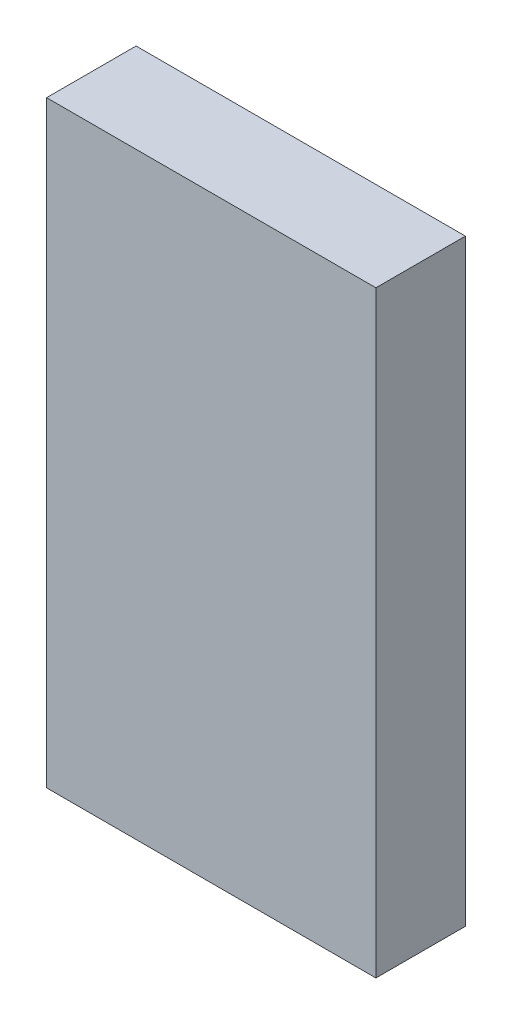
ISO-10303-21;
HEADER;
FILE_DESCRIPTION(('STEP AP214'),'2;1');
FILE_NAME('part.step','',(''),(''),'','','');
FILE_SCHEMA(('AUTOMOTIVE_DESIGN { 1 0 10303 214 1 1 1 1 }'));
ENDSEC;
DATA;
#1=APPLICATION_CONTEXT('core data for automotive mechanical design processes');
#2=APPLICATION_PROTOCOL_DEFINITION('international standard','automotive_design',2000,#1);
#3=PRODUCT_CONTEXT('',#1,'mechanical');
#4=PRODUCT('Part','Part','',(#3));
#5=PRODUCT_RELATED_PRODUCT_CATEGORY('part','',(#4));
#6=PRODUCT_DEFINITION_FORMATION('','',#4);
#7=PRODUCT_DEFINITION_CONTEXT('part definition',#1,'design');
#8=PRODUCT_DEFINITION('design','',#6,#7);
#9=PRODUCT_DEFINITION_SHAPE('','',#8);
#10=(LENGTH_UNIT() NAMED_UNIT(*) SI_UNIT(.MILLI.,.METRE.));
#11=(NAMED_UNIT(*) PLANE_ANGLE_UNIT() SI_UNIT($,.RADIAN.));
#12=(NAMED_UNIT(*) SI_UNIT($,.STERADIAN.) SOLID_ANGLE_UNIT());
#13=UNCERTAINTY_MEASURE_WITH_UNIT(LENGTH_MEASURE(1.E-05),#10,'distance_accuracy_value','');
#14=(GEOMETRIC_REPRESENTATION_CONTEXT(3) GLOBAL_UNCERTAINTY_ASSIGNED_CONTEXT((#13)) GLOBAL_UNIT_ASSIGNED_CONTEXT((#10,
#11,#12)) REPRESENTATION_CONTEXT('',''));
#15=CARTESIAN_POINT('',(0.,0.,0.));
#16=DIRECTION('',(0.,0.,1.));
#17=DIRECTION('',(1.,0.,0.));
#18=AXIS2_PLACEMENT_3D('',#15,#16,#17);
#19=CARTESIAN_POINT('',(-0.514,0.771,0.));
#20=DIRECTION('',(1.,0.,0.));
#21=DIRECTION('',(0.,0.,1.));
#22=AXIS2_PLACEMENT_3D('',#19,#20,#21);
#23=PLANE('',#22);
#24=DIRECTION('',(0.,1.,0.));
#25=VECTOR('',#24,1.);
#26=CARTESIAN_POINT('',(-0.514,0.771,0.1));
#27=LINE('',#26,#25);
#28=CARTESIAN_POINT('',(-0.514,0.771,0.1));
#29=VERTEX_POINT('',#28);
#30=CARTESIAN_POINT('',(-0.514,1.439,0.1));
#31=VERTEX_POINT('',#30);
#32=EDGE_CURVE('E11',#29,#31,#27,.T.);
#33=ORIENTED_EDGE('',*,*,#32,.T.);
#34=DIRECTION('',(0.,0.,1.));
#35=VECTOR('',#34,1.);
#36=CARTESIAN_POINT('',(-0.514,1.439,0.));
#37=LINE('',#36,#35);
#38=CARTESIAN_POINT('',(-0.514,1.439,0.));
#39=VERTEX_POINT('',#38);
#40=EDGE_CURVE('E24',#39,#31,#37,.T.);
#41=ORIENTED_EDGE('',*,*,#40,.F.);
#42=DIRECTION('',(0.,1.,0.));
#43=VECTOR('',#42,1.);
#44=CARTESIAN_POINT('',(-0.514,0.771,0.));
#45=LINE('',#44,#43);
#46=CARTESIAN_POINT('',(-0.514,0.771,0.));
#47=VERTEX_POINT('',#46);
#48=EDGE_CURVE('E86',#47,#39,#45,.T.);
#49=ORIENTED_EDGE('',*,*,#48,.F.);
#50=DIRECTION('',(0.,0.,1.));
#51=VECTOR('',#50,1.);
#52=CARTESIAN_POINT('',(-0.514,0.771,0.));
#53=LINE('',#52,#51);
#54=EDGE_CURVE('E36',#47,#29,#53,.T.);
#55=ORIENTED_EDGE('',*,*,#54,.T.);
#56=EDGE_LOOP('',(#33,#41,#49,#55));
#57=FACE_BOUND('',#56,.T.);
#58=ADVANCED_FACE('F17',(#57),#23,.F.);
#59=CARTESIAN_POINT('',(-0.146,0.771,0.));
#60=DIRECTION('',(1.,0.,0.));
#61=DIRECTION('',(0.,0.,1.));
#62=AXIS2_PLACEMENT_3D('',#59,#60,#61);
#63=PLANE('',#62);
#64=DIRECTION('',(0.,0.,1.));
#65=VECTOR('',#64,1.);
#66=CARTESIAN_POINT('',(-0.146,0.771,0.));
#67=LINE('',#66,#65);
#68=CARTESIAN_POINT('',(-0.146,0.771,0.));
#69=VERTEX_POINT('',#68);
#70=CARTESIAN_POINT('',(-0.146,0.771,0.1));
#71=VERTEX_POINT('',#70);
#72=EDGE_CURVE('E83',#69,#71,#67,.T.);
#73=ORIENTED_EDGE('',*,*,#72,.F.);
#74=DIRECTION('',(0.,1.,0.));
#75=VECTOR('',#74,1.);
#76=CARTESIAN_POINT('',(-0.146,0.771,0.));
#77=LINE('',#76,#75);
#78=CARTESIAN_POINT('',(-0.146,1.439,0.));
#79=VERTEX_POINT('',#78);
#80=EDGE_CURVE('E63',#69,#79,#77,.T.);
#81=ORIENTED_EDGE('',*,*,#80,.T.);
#82=DIRECTION('',(0.,0.,1.));
#83=VECTOR('',#82,1.);
#84=CARTESIAN_POINT('',(-0.146,1.439,0.));
#85=LINE('',#84,#83);
#86=CARTESIAN_POINT('',(-0.146,1.439,0.1));
#87=VERTEX_POINT('',#86);
#88=EDGE_CURVE('E57',#79,#87,#85,.T.);
#89=ORIENTED_EDGE('',*,*,#88,.T.);
#90=DIRECTION('',(0.,1.,0.));
#91=VECTOR('',#90,1.);
#92=CARTESIAN_POINT('',(-0.146,0.771,0.1));
#93=LINE('',#92,#91);
#94=EDGE_CURVE('E60',#71,#87,#93,.T.);
#95=ORIENTED_EDGE('',*,*,#94,.F.);
#96=EDGE_LOOP('',(#73,#81,#89,#95));
#97=FACE_BOUND('',#96,.T.);
#98=ADVANCED_FACE('F59',(#97),#63,.T.);
#99=CARTESIAN_POINT('',(-0.514,0.771,0.));
#100=DIRECTION('',(0.,1.,0.));
#101=DIRECTION('',(0.,0.,1.));
#102=AXIS2_PLACEMENT_3D('',#99,#100,#101);
#103=PLANE('',#102);
#104=ORIENTED_EDGE('',*,*,#72,.T.);
#105=DIRECTION('',(1.,0.,0.));
#106=VECTOR('',#105,1.);
#107=CARTESIAN_POINT('',(-0.514,0.771,0.1));
#108=LINE('',#107,#106);
#109=EDGE_CURVE('E71',#29,#71,#108,.T.);
#110=ORIENTED_EDGE('',*,*,#109,.F.);
#111=ORIENTED_EDGE('',*,*,#54,.F.);
#112=DIRECTION('',(1.,0.,0.));
#113=VECTOR('',#112,1.);
#114=CARTESIAN_POINT('',(-0.514,0.771,0.));
#115=LINE('',#114,#113);
#116=EDGE_CURVE('E76',#47,#69,#115,.T.);
#117=ORIENTED_EDGE('',*,*,#116,.T.);
#118=EDGE_LOOP('',(#104,#110,#111,#117));
#119=FACE_BOUND('',#118,.T.);
#120=ADVANCED_FACE('F91',(#119),#103,.F.);
#121=CARTESIAN_POINT('',(-0.514,1.439,0.));
#122=DIRECTION('',(0.,1.,0.));
#123=DIRECTION('',(0.,0.,1.));
#124=AXIS2_PLACEMENT_3D('',#121,#122,#123);
#125=PLANE('',#124);
#126=DIRECTION('',(1.,0.,0.));
#127=VECTOR('',#126,1.);
#128=CARTESIAN_POINT('',(-0.514,1.439,0.));
#129=LINE('',#128,#127);
#130=EDGE_CURVE('E74',#39,#79,#129,.T.);
#131=ORIENTED_EDGE('',*,*,#130,.F.);
#132=ORIENTED_EDGE('',*,*,#40,.T.);
#133=DIRECTION('',(1.,0.,0.));
#134=VECTOR('',#133,1.);
#135=CARTESIAN_POINT('',(-0.514,1.439,0.1));
#136=LINE('',#135,#134);
#137=EDGE_CURVE('E69',#31,#87,#136,.T.);
#138=ORIENTED_EDGE('',*,*,#137,.T.);
#139=ORIENTED_EDGE('',*,*,#88,.F.);
#140=EDGE_LOOP('',(#131,#132,#138,#139));
#141=FACE_BOUND('',#140,.T.);
#142=ADVANCED_FACE('F73',(#141),#125,.T.);
#143=CARTESIAN_POINT('',(-0.514,0.771,0.));
#144=DIRECTION('',(0.,0.,1.));
#145=DIRECTION('',(1.,0.,0.));
#146=AXIS2_PLACEMENT_3D('',#143,#144,#145);
#147=PLANE('',#146);
#148=ORIENTED_EDGE('',*,*,#130,.T.);
#149=ORIENTED_EDGE('',*,*,#80,.F.);
#150=ORIENTED_EDGE('',*,*,#116,.F.);
#151=ORIENTED_EDGE('',*,*,#48,.T.);
#152=EDGE_LOOP('',(#148,#149,#150,#151));
#153=FACE_BOUND('',#152,.T.);
#154=ADVANCED_FACE('F89',(#153),#147,.F.);
#155=CARTESIAN_POINT('',(-0.514,0.771,0.1));
#156=DIRECTION('',(0.,0.,1.));
#157=DIRECTION('',(1.,0.,0.));
#158=AXIS2_PLACEMENT_3D('',#155,#156,#157);
#159=PLANE('',#158);
#160=ORIENTED_EDGE('',*,*,#32,.F.);
#161=ORIENTED_EDGE('',*,*,#109,.T.);
#162=ORIENTED_EDGE('',*,*,#94,.T.);
#163=ORIENTED_EDGE('',*,*,#137,.F.);
#164=EDGE_LOOP('',(#160,#161,#162,#163));
#165=FACE_BOUND('',#164,.T.);
#166=ADVANCED_FACE('F68',(#165),#159,.T.);
#167=CLOSED_SHELL('',(#58,#98,#120,#142,#154,#166));
#168=MANIFOLD_SOLID_BREP('B1',#167);
#169=ADVANCED_BREP_SHAPE_REPRESENTATION('',(#18,#168),#14);
#170=SHAPE_DEFINITION_REPRESENTATION(#9,#169);
ENDSEC;
END-ISO-10303-21;
